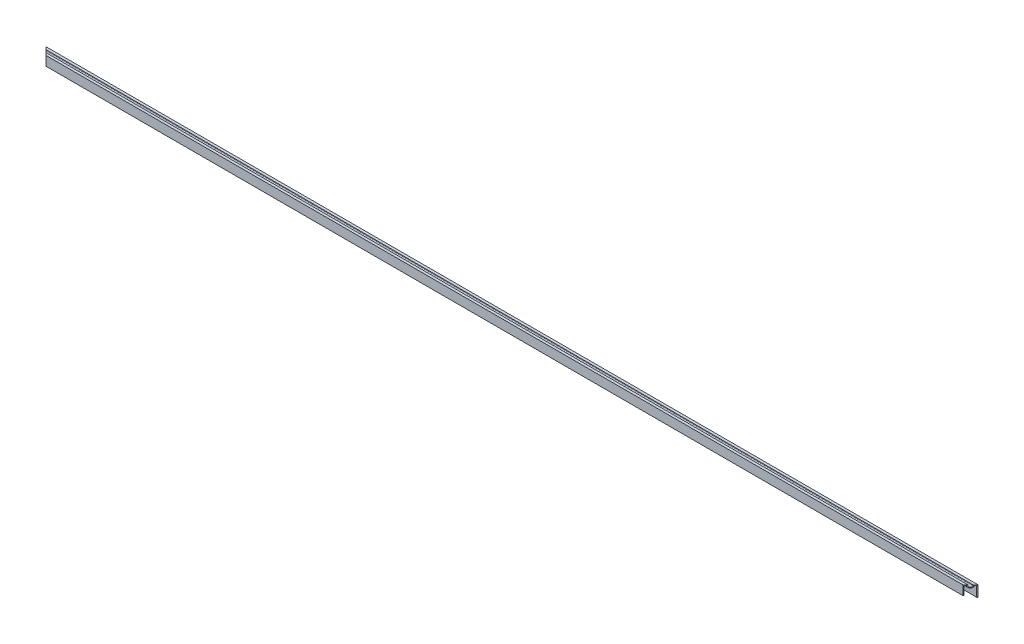
ISO-10303-21;
HEADER;
FILE_DESCRIPTION(('STEP AP214'),'2;1');
FILE_NAME('part.step','',(''),(''),'','','');
FILE_SCHEMA(('AUTOMOTIVE_DESIGN { 1 0 10303 214 1 1 1 1 }'));
ENDSEC;
DATA;
#1=APPLICATION_CONTEXT('core data for automotive mechanical design processes');
#2=APPLICATION_PROTOCOL_DEFINITION('international standard','automotive_design',2000,#1);
#3=PRODUCT_CONTEXT('',#1,'mechanical');
#4=PRODUCT('Part','Part','',(#3));
#5=PRODUCT_RELATED_PRODUCT_CATEGORY('part','',(#4));
#6=PRODUCT_DEFINITION_FORMATION('','',#4);
#7=PRODUCT_DEFINITION_CONTEXT('part definition',#1,'design');
#8=PRODUCT_DEFINITION('design','',#6,#7);
#9=PRODUCT_DEFINITION_SHAPE('','',#8);
#10=(LENGTH_UNIT() NAMED_UNIT(*) SI_UNIT(.MILLI.,.METRE.));
#11=(NAMED_UNIT(*) PLANE_ANGLE_UNIT() SI_UNIT($,.RADIAN.));
#12=(NAMED_UNIT(*) SI_UNIT($,.STERADIAN.) SOLID_ANGLE_UNIT());
#13=UNCERTAINTY_MEASURE_WITH_UNIT(LENGTH_MEASURE(1.E-05),#10,'distance_accuracy_value','');
#14=(GEOMETRIC_REPRESENTATION_CONTEXT(3) GLOBAL_UNCERTAINTY_ASSIGNED_CONTEXT((#13)) GLOBAL_UNIT_ASSIGNED_CONTEXT((#10,
#11,#12)) REPRESENTATION_CONTEXT('',''));
#15=CARTESIAN_POINT('',(0.,0.,0.));
#16=DIRECTION('',(0.,0.,1.));
#17=DIRECTION('',(1.,0.,0.));
#18=AXIS2_PLACEMENT_3D('',#15,#16,#17);
#19=CARTESIAN_POINT('',(934.24375,0.,0.));
#20=DIRECTION('',(0.,1.,0.));
#21=DIRECTION('',(0.,0.,1.));
#22=AXIS2_PLACEMENT_3D('',#19,#20,#21);
#23=PLANE('',#22);
#24=DIRECTION('',(-1.,0.,0.));
#25=VECTOR('',#24,1.);
#26=CARTESIAN_POINT('',(934.24375,0.,1.27));
#27=LINE('',#26,#25);
#28=CARTESIAN_POINT('',(932.97375,0.,1.27));
#29=VERTEX_POINT('',#28);
#30=CARTESIAN_POINT('',(-932.97375,0.,1.27000000000001));
#31=VERTEX_POINT('',#30);
#32=EDGE_CURVE('E169',#29,#31,#27,.T.);
#33=ORIENTED_EDGE('',*,*,#32,.T.);
#34=DIRECTION('',(-0.707106781186548,0.,-0.707106781186547));
#35=VECTOR('',#34,1.);
#36=CARTESIAN_POINT('',(-934.24375,0.,0.));
#37=LINE('',#36,#35);
#38=CARTESIAN_POINT('',(-934.24375,0.,0.));
#39=VERTEX_POINT('',#38);
#40=EDGE_CURVE('E155',#31,#39,#37,.T.);
#41=ORIENTED_EDGE('',*,*,#40,.T.);
#42=DIRECTION('',(-1.,0.,0.));
#43=VECTOR('',#42,1.);
#44=CARTESIAN_POINT('',(934.24375,0.,0.));
#45=LINE('',#44,#43);
#46=CARTESIAN_POINT('',(934.24375,0.,0.));
#47=VERTEX_POINT('',#46);
#48=EDGE_CURVE('E11',#47,#39,#45,.T.);
#49=ORIENTED_EDGE('',*,*,#48,.F.);
#50=DIRECTION('',(-0.707106781186548,0.,0.707106781186547));
#51=VECTOR('',#50,1.);
#52=CARTESIAN_POINT('',(934.24375,0.,0.));
#53=LINE('',#52,#51);
#54=EDGE_CURVE('E59',#47,#29,#53,.T.);
#55=ORIENTED_EDGE('',*,*,#54,.T.);
#56=EDGE_LOOP('',(#33,#41,#49,#55));
#57=FACE_BOUND('',#56,.T.);
#58=ADVANCED_FACE('F45',(#57),#23,.F.);
#59=CARTESIAN_POINT('',(934.24375,0.,0.));
#60=DIRECTION('',(0.,0.,1.));
#61=DIRECTION('',(1.,0.,0.));
#62=AXIS2_PLACEMENT_3D('',#59,#60,#61);
#63=PLANE('',#62);
#64=DIRECTION('',(0.,1.,0.));
#65=VECTOR('',#64,1.);
#66=CARTESIAN_POINT('',(-934.24375,0.,0.));
#67=LINE('',#66,#65);
#68=CARTESIAN_POINT('',(-934.24375,21.844,0.));
#69=VERTEX_POINT('',#68);
#70=EDGE_CURVE('E152',#39,#69,#67,.T.);
#71=ORIENTED_EDGE('',*,*,#70,.T.);
#72=DIRECTION('',(-1.,0.,0.));
#73=VECTOR('',#72,1.);
#74=CARTESIAN_POINT('',(934.24375,21.844,0.));
#75=LINE('',#74,#73);
#76=CARTESIAN_POINT('',(934.24375,21.844,0.));
#77=VERTEX_POINT('',#76);
#78=EDGE_CURVE('E53',#77,#69,#75,.T.);
#79=ORIENTED_EDGE('',*,*,#78,.F.);
#80=DIRECTION('',(0.,1.,0.));
#81=VECTOR('',#80,1.);
#82=CARTESIAN_POINT('',(934.24375,0.,0.));
#83=LINE('',#82,#81);
#84=EDGE_CURVE('E162',#47,#77,#83,.T.);
#85=ORIENTED_EDGE('',*,*,#84,.F.);
#86=ORIENTED_EDGE('',*,*,#48,.T.);
#87=EDGE_LOOP('',(#71,#79,#85,#86));
#88=FACE_BOUND('',#87,.T.);
#89=ADVANCED_FACE('F173',(#88),#63,.F.);
#90=CARTESIAN_POINT('',(934.24375,21.844,0.));
#91=DIRECTION('',(0.,-1.,0.));
#92=DIRECTION('',(0.,0.,-1.));
#93=AXIS2_PLACEMENT_3D('',#90,#91,#92);
#94=PLANE('',#93);
#95=ORIENTED_EDGE('',*,*,#78,.T.);
#96=DIRECTION('',(-0.707106781186548,0.,-0.707106781186547));
#97=VECTOR('',#96,1.);
#98=CARTESIAN_POINT('',(-934.24375,21.844,0.));
#99=LINE('',#98,#97);
#100=CARTESIAN_POINT('',(-929.16375,21.844,5.07999999999993));
#101=VERTEX_POINT('',#100);
#102=EDGE_CURVE('E158',#101,#69,#99,.T.);
#103=ORIENTED_EDGE('',*,*,#102,.F.);
#104=DIRECTION('',(-1.,0.,0.));
#105=VECTOR('',#104,1.);
#106=CARTESIAN_POINT('',(934.24375,21.844,5.08));
#107=LINE('',#106,#105);
#108=CARTESIAN_POINT('',(929.16375,21.844,5.08));
#109=VERTEX_POINT('',#108);
#110=EDGE_CURVE('E216',#109,#101,#107,.T.);
#111=ORIENTED_EDGE('',*,*,#110,.F.);
#112=DIRECTION('',(-0.707106781186548,0.,0.707106781186547));
#113=VECTOR('',#112,1.);
#114=CARTESIAN_POINT('',(934.24375,21.844,0.));
#115=LINE('',#114,#113);
#116=EDGE_CURVE('E221',#77,#109,#115,.T.);
#117=ORIENTED_EDGE('',*,*,#116,.F.);
#118=EDGE_LOOP('',(#95,#103,#111,#117));
#119=FACE_BOUND('',#118,.T.);
#120=ADVANCED_FACE('F219',(#119),#94,.F.);
#121=CARTESIAN_POINT('',(934.24375,21.844,5.08));
#122=DIRECTION('',(0.,0.,-1.));
#123=DIRECTION('',(-1.,0.,0.));
#124=AXIS2_PLACEMENT_3D('',#121,#122,#123);
#125=PLANE('',#124);
#126=ORIENTED_EDGE('',*,*,#110,.T.);
#127=DIRECTION('',(0.,-1.,0.));
#128=VECTOR('',#127,1.);
#129=CARTESIAN_POINT('',(-929.16375,21.8439999999987,5.08));
#130=LINE('',#129,#128);
#131=CARTESIAN_POINT('',(-929.16375,20.066,5.08));
#132=VERTEX_POINT('',#131);
#133=EDGE_CURVE('E227',#101,#132,#130,.T.);
#134=ORIENTED_EDGE('',*,*,#133,.T.);
#135=DIRECTION('',(-1.,0.,0.));
#136=VECTOR('',#135,1.);
#137=CARTESIAN_POINT('',(934.24375,20.066,5.08));
#138=LINE('',#137,#136);
#139=CARTESIAN_POINT('',(929.16375,20.066,5.08));
#140=VERTEX_POINT('',#139);
#141=EDGE_CURVE('E213',#140,#132,#138,.T.);
#142=ORIENTED_EDGE('',*,*,#141,.F.);
#143=DIRECTION('',(0.,1.,0.));
#144=VECTOR('',#143,1.);
#145=CARTESIAN_POINT('',(929.16375,21.844,5.08));
#146=LINE('',#145,#144);
#147=EDGE_CURVE('E163',#140,#109,#146,.T.);
#148=ORIENTED_EDGE('',*,*,#147,.T.);
#149=EDGE_LOOP('',(#126,#134,#142,#148));
#150=FACE_BOUND('',#149,.T.);
#151=ADVANCED_FACE('F264',(#150),#125,.F.);
#152=CARTESIAN_POINT('',(934.24375,20.066,7.62));
#153=DIRECTION('',(-1.,0.,0.));
#154=DIRECTION('',(0.,0.,1.));
#155=AXIS2_PLACEMENT_3D('',#152,#153,#154);
#156=CYLINDRICAL_SURFACE('',#155,2.54);
#157=ORIENTED_EDGE('',*,*,#141,.T.);
#158=CARTESIAN_POINT('',(-926.62375,20.066,7.62));
#159=DIRECTION('',(0.707106781186547,0.,-0.707106781186548));
#160=DIRECTION('',(-0.707106781186548,0.,-0.707106781186547));
#161=AXIS2_PLACEMENT_3D('',#158,#159,#160);
#162=ELLIPSE('',#161,3.59210244842767,2.54);
#163=CARTESIAN_POINT('',(-924.08375,20.066,10.16));
#164=VERTEX_POINT('',#163);
#165=EDGE_CURVE('E274',#132,#164,#162,.F.);
#166=ORIENTED_EDGE('',*,*,#165,.T.);
#167=DIRECTION('',(-1.,0.,0.));
#168=VECTOR('',#167,1.);
#169=CARTESIAN_POINT('',(934.24375,20.066,10.16));
#170=LINE('',#169,#168);
#171=CARTESIAN_POINT('',(924.08375,20.066,10.16));
#172=VERTEX_POINT('',#171);
#173=EDGE_CURVE('E210',#172,#164,#170,.T.);
#174=ORIENTED_EDGE('',*,*,#173,.F.);
#175=CARTESIAN_POINT('',(926.62375,20.066,7.62));
#176=DIRECTION('',(-0.707106781186547,0.,-0.707106781186548));
#177=DIRECTION('',(-0.707106781186548,0.,0.707106781186547));
#178=AXIS2_PLACEMENT_3D('',#175,#176,#177);
#179=ELLIPSE('',#178,3.59210244842767,2.54);
#180=EDGE_CURVE('E258',#172,#140,#179,.F.);
#181=ORIENTED_EDGE('',*,*,#180,.T.);
#182=EDGE_LOOP('',(#157,#166,#174,#181));
#183=FACE_BOUND('',#182,.T.);
#184=ADVANCED_FACE('F273',(#183),#156,.F.);
#185=CARTESIAN_POINT('',(934.24375,20.066,10.16));
#186=DIRECTION('',(0.,0.,1.));
#187=DIRECTION('',(0.,-1.,0.));
#188=AXIS2_PLACEMENT_3D('',#185,#186,#187);
#189=PLANE('',#188);
#190=ORIENTED_EDGE('',*,*,#173,.T.);
#191=DIRECTION('',(0.,1.,0.));
#192=VECTOR('',#191,1.);
#193=CARTESIAN_POINT('',(-924.08375,20.0659999999969,10.16));
#194=LINE('',#193,#192);
#195=CARTESIAN_POINT('',(-924.08375,21.844,10.1600000000001));
#196=VERTEX_POINT('',#195);
#197=EDGE_CURVE('E275',#164,#196,#194,.T.);
#198=ORIENTED_EDGE('',*,*,#197,.T.);
#199=DIRECTION('',(-1.,0.,0.));
#200=VECTOR('',#199,1.);
#201=CARTESIAN_POINT('',(934.24375,21.844,10.16));
#202=LINE('',#201,#200);
#203=CARTESIAN_POINT('',(924.08375,21.844,10.16));
#204=VERTEX_POINT('',#203);
#205=EDGE_CURVE('E207',#204,#196,#202,.T.);
#206=ORIENTED_EDGE('',*,*,#205,.F.);
#207=DIRECTION('',(0.,-1.,0.));
#208=VECTOR('',#207,1.);
#209=CARTESIAN_POINT('',(924.08375,20.066,10.16));
#210=LINE('',#209,#208);
#211=EDGE_CURVE('E256',#204,#172,#210,.T.);
#212=ORIENTED_EDGE('',*,*,#211,.T.);
#213=EDGE_LOOP('',(#190,#198,#206,#212));
#214=FACE_BOUND('',#213,.T.);
#215=ADVANCED_FACE('F270',(#214),#189,.F.);
#216=CARTESIAN_POINT('',(934.24375,21.844,10.16));
#217=DIRECTION('',(0.,-1.,0.));
#218=DIRECTION('',(0.,0.,-1.));
#219=AXIS2_PLACEMENT_3D('',#216,#217,#218);
#220=PLANE('',#219);
#221=ORIENTED_EDGE('',*,*,#205,.T.);
#222=CARTESIAN_POINT('',(-919.00375,21.844,15.24));
#223=VERTEX_POINT('',#222);
#224=EDGE_CURVE('E171',#223,#196,#99,.T.);
#225=ORIENTED_EDGE('',*,*,#224,.F.);
#226=DIRECTION('',(-1.,0.,0.));
#227=VECTOR('',#226,1.);
#228=CARTESIAN_POINT('',(934.24375,21.844,15.24));
#229=LINE('',#228,#227);
#230=CARTESIAN_POINT('',(919.00375,21.844,15.24));
#231=VERTEX_POINT('',#230);
#232=EDGE_CURVE('E204',#231,#223,#229,.T.);
#233=ORIENTED_EDGE('',*,*,#232,.F.);
#234=EDGE_CURVE('E223',#204,#231,#115,.T.);
#235=ORIENTED_EDGE('',*,*,#234,.F.);
#236=EDGE_LOOP('',(#221,#225,#233,#235));
#237=FACE_BOUND('',#236,.T.);
#238=ADVANCED_FACE('F307',(#237),#220,.F.);
#239=CARTESIAN_POINT('',(934.24375,21.844,15.24));
#240=DIRECTION('',(0.,0.,-1.));
#241=DIRECTION('',(0.,1.,0.));
#242=AXIS2_PLACEMENT_3D('',#239,#240,#241);
#243=PLANE('',#242);
#244=ORIENTED_EDGE('',*,*,#232,.T.);
#245=DIRECTION('',(0.,1.,0.));
#246=VECTOR('',#245,1.);
#247=CARTESIAN_POINT('',(-919.00375,0.,15.24));
#248=LINE('',#247,#246);
#249=CARTESIAN_POINT('',(-919.00375,3.048,15.24));
#250=VERTEX_POINT('',#249);
#251=EDGE_CURVE('E170',#250,#223,#248,.T.);
#252=ORIENTED_EDGE('',*,*,#251,.F.);
#253=DIRECTION('',(-1.,0.,0.));
#254=VECTOR('',#253,1.);
#255=CARTESIAN_POINT('',(934.24375,3.048,15.24));
#256=LINE('',#255,#254);
#257=CARTESIAN_POINT('',(919.00375,3.048,15.24));
#258=VERTEX_POINT('',#257);
#259=EDGE_CURVE('E201',#258,#250,#256,.T.);
#260=ORIENTED_EDGE('',*,*,#259,.F.);
#261=DIRECTION('',(0.,1.,0.));
#262=VECTOR('',#261,1.);
#263=CARTESIAN_POINT('',(919.00375,0.,15.24));
#264=LINE('',#263,#262);
#265=EDGE_CURVE('E225',#258,#231,#264,.T.);
#266=ORIENTED_EDGE('',*,*,#265,.T.);
#267=EDGE_LOOP('',(#244,#252,#260,#266));
#268=FACE_BOUND('',#267,.T.);
#269=ADVANCED_FACE('F310',(#268),#243,.F.);
#270=CARTESIAN_POINT('',(934.24375,3.048,15.24));
#271=DIRECTION('',(0.,1.,0.));
#272=DIRECTION('',(0.,0.,1.));
#273=AXIS2_PLACEMENT_3D('',#270,#271,#272);
#274=PLANE('',#273);
#275=ORIENTED_EDGE('',*,*,#259,.T.);
#276=DIRECTION('',(-0.707106781186548,0.,-0.707106781186547));
#277=VECTOR('',#276,1.);
#278=CARTESIAN_POINT('',(7.62000000000218,3.048,941.86375));
#279=LINE('',#278,#277);
#280=CARTESIAN_POINT('',(-920.27375,3.048,13.97));
#281=VERTEX_POINT('',#280);
#282=EDGE_CURVE('E277',#250,#281,#279,.T.);
#283=ORIENTED_EDGE('',*,*,#282,.T.);
#284=DIRECTION('',(-1.,0.,0.));
#285=VECTOR('',#284,1.);
#286=CARTESIAN_POINT('',(934.24375,3.048,13.97));
#287=LINE('',#286,#285);
#288=CARTESIAN_POINT('',(920.27375,3.048,13.97));
#289=VERTEX_POINT('',#288);
#290=EDGE_CURVE('E198',#289,#281,#287,.T.);
#291=ORIENTED_EDGE('',*,*,#290,.F.);
#292=DIRECTION('',(-0.707106781186548,0.,0.707106781186547));
#293=VECTOR('',#292,1.);
#294=CARTESIAN_POINT('',(926.62375,3.048,7.61999999999997));
#295=LINE('',#294,#293);
#296=EDGE_CURVE('E253',#289,#258,#295,.T.);
#297=ORIENTED_EDGE('',*,*,#296,.T.);
#298=EDGE_LOOP('',(#275,#283,#291,#297));
#299=FACE_BOUND('',#298,.T.);
#300=ADVANCED_FACE('F312',(#299),#274,.F.);
#301=CARTESIAN_POINT('',(934.24375,20.574,13.97));
#302=DIRECTION('',(0.,0.,1.));
#303=DIRECTION('',(1.,0.,0.));
#304=AXIS2_PLACEMENT_3D('',#301,#302,#303);
#305=PLANE('',#304);
#306=ORIENTED_EDGE('',*,*,#290,.T.);
#307=DIRECTION('',(0.,1.,0.));
#308=VECTOR('',#307,1.);
#309=CARTESIAN_POINT('',(-920.27375,20.5739999999987,13.97));
#310=LINE('',#309,#308);
#311=CARTESIAN_POINT('',(-920.27375,20.574,13.9699999999999));
#312=VERTEX_POINT('',#311);
#313=EDGE_CURVE('E282',#281,#312,#310,.T.);
#314=ORIENTED_EDGE('',*,*,#313,.T.);
#315=DIRECTION('',(-1.,0.,0.));
#316=VECTOR('',#315,1.);
#317=CARTESIAN_POINT('',(934.24375,20.574,13.97));
#318=LINE('',#317,#316);
#319=CARTESIAN_POINT('',(920.27375,20.574,13.97));
#320=VERTEX_POINT('',#319);
#321=EDGE_CURVE('E195',#320,#312,#318,.T.);
#322=ORIENTED_EDGE('',*,*,#321,.F.);
#323=DIRECTION('',(0.,-1.,0.));
#324=VECTOR('',#323,1.);
#325=CARTESIAN_POINT('',(920.27375,20.574,13.97));
#326=LINE('',#325,#324);
#327=EDGE_CURVE('E250',#320,#289,#326,.T.);
#328=ORIENTED_EDGE('',*,*,#327,.T.);
#329=EDGE_LOOP('',(#306,#314,#322,#328));
#330=FACE_BOUND('',#329,.T.);
#331=ADVANCED_FACE('F316',(#330),#305,.F.);
#332=CARTESIAN_POINT('',(934.24375,20.574,11.43));
#333=DIRECTION('',(0.,1.,0.));
#334=DIRECTION('',(0.,0.,1.));
#335=AXIS2_PLACEMENT_3D('',#332,#333,#334);
#336=PLANE('',#335);
#337=ORIENTED_EDGE('',*,*,#321,.T.);
#338=DIRECTION('',(-0.707106781186548,0.,-0.707106781186547));
#339=VECTOR('',#338,1.);
#340=CARTESIAN_POINT('',(5.71500000000225,20.574,939.95875));
#341=LINE('',#340,#339);
#342=CARTESIAN_POINT('',(-922.81375,20.574,11.43));
#343=VERTEX_POINT('',#342);
#344=EDGE_CURVE('E285',#312,#343,#341,.T.);
#345=ORIENTED_EDGE('',*,*,#344,.T.);
#346=DIRECTION('',(-1.,0.,0.));
#347=VECTOR('',#346,1.);
#348=CARTESIAN_POINT('',(934.24375,20.574,11.43));
#349=LINE('',#348,#347);
#350=CARTESIAN_POINT('',(922.81375,20.574,11.43));
#351=VERTEX_POINT('',#350);
#352=EDGE_CURVE('E192',#351,#343,#349,.T.);
#353=ORIENTED_EDGE('',*,*,#352,.F.);
#354=DIRECTION('',(-0.707106781186548,0.,0.707106781186547));
#355=VECTOR('',#354,1.);
#356=CARTESIAN_POINT('',(928.52875,20.574,5.71499999999998));
#357=LINE('',#356,#355);
#358=EDGE_CURVE('E247',#351,#320,#357,.T.);
#359=ORIENTED_EDGE('',*,*,#358,.T.);
#360=EDGE_LOOP('',(#337,#345,#353,#359));
#361=FACE_BOUND('',#360,.T.);
#362=ADVANCED_FACE('F318',(#361),#336,.F.);
#363=CARTESIAN_POINT('',(934.24375,20.066,11.43));
#364=DIRECTION('',(0.,0.,-1.));
#365=DIRECTION('',(-1.,0.,0.));
#366=AXIS2_PLACEMENT_3D('',#363,#364,#365);
#367=PLANE('',#366);
#368=ORIENTED_EDGE('',*,*,#352,.T.);
#369=DIRECTION('',(0.,-1.,0.));
#370=VECTOR('',#369,1.);
#371=CARTESIAN_POINT('',(-922.81375,20.0659999999987,11.43));
#372=LINE('',#371,#370);
#373=CARTESIAN_POINT('',(-922.81375,20.066,11.43));
#374=VERTEX_POINT('',#373);
#375=EDGE_CURVE('E288',#343,#374,#372,.T.);
#376=ORIENTED_EDGE('',*,*,#375,.T.);
#377=DIRECTION('',(-1.,0.,0.));
#378=VECTOR('',#377,1.);
#379=CARTESIAN_POINT('',(934.24375,20.066,11.43));
#380=LINE('',#379,#378);
#381=CARTESIAN_POINT('',(922.81375,20.066,11.43));
#382=VERTEX_POINT('',#381);
#383=EDGE_CURVE('E189',#382,#374,#380,.T.);
#384=ORIENTED_EDGE('',*,*,#383,.F.);
#385=DIRECTION('',(0.,1.,0.));
#386=VECTOR('',#385,1.);
#387=CARTESIAN_POINT('',(922.81375,20.066,11.43));
#388=LINE('',#387,#386);
#389=EDGE_CURVE('E244',#382,#351,#388,.T.);
#390=ORIENTED_EDGE('',*,*,#389,.T.);
#391=EDGE_LOOP('',(#368,#376,#384,#390));
#392=FACE_BOUND('',#391,.T.);
#393=ADVANCED_FACE('F322',(#392),#367,.F.);
#394=CARTESIAN_POINT('',(934.24375,20.066,7.62));
#395=DIRECTION('',(-1.,0.,0.));
#396=DIRECTION('',(0.,0.,1.));
#397=AXIS2_PLACEMENT_3D('',#394,#395,#396);
#398=CYLINDRICAL_SURFACE('',#397,3.81);
#399=ORIENTED_EDGE('',*,*,#383,.T.);
#400=CARTESIAN_POINT('',(-926.62375,20.066,7.62));
#401=DIRECTION('',(0.707106781186547,0.,-0.707106781186548));
#402=DIRECTION('',(-0.707106781186548,0.,-0.707106781186547));
#403=AXIS2_PLACEMENT_3D('',#400,#401,#402);
#404=ELLIPSE('',#403,5.3881536726415,3.81);
#405=CARTESIAN_POINT('',(-930.43375,20.066,3.81));
#406=VERTEX_POINT('',#405);
#407=EDGE_CURVE('E291',#374,#406,#404,.T.);
#408=ORIENTED_EDGE('',*,*,#407,.T.);
#409=DIRECTION('',(-1.,0.,0.));
#410=VECTOR('',#409,1.);
#411=CARTESIAN_POINT('',(934.24375,20.066,3.81));
#412=LINE('',#411,#410);
#413=CARTESIAN_POINT('',(930.43375,20.066,3.81));
#414=VERTEX_POINT('',#413);
#415=EDGE_CURVE('E186',#414,#406,#412,.T.);
#416=ORIENTED_EDGE('',*,*,#415,.F.);
#417=CARTESIAN_POINT('',(926.62375,20.066,7.62));
#418=DIRECTION('',(-0.707106781186547,0.,-0.707106781186548));
#419=DIRECTION('',(-0.707106781186548,0.,0.707106781186547));
#420=AXIS2_PLACEMENT_3D('',#417,#418,#419);
#421=ELLIPSE('',#420,5.3881536726415,3.81);
#422=EDGE_CURVE('E241',#414,#382,#421,.T.);
#423=ORIENTED_EDGE('',*,*,#422,.T.);
#424=EDGE_LOOP('',(#399,#408,#416,#423));
#425=FACE_BOUND('',#424,.T.);
#426=ADVANCED_FACE('F324',(#425),#398,.T.);
#427=CARTESIAN_POINT('',(934.24375,20.574,3.81));
#428=DIRECTION('',(0.,0.,1.));
#429=DIRECTION('',(1.,0.,0.));
#430=AXIS2_PLACEMENT_3D('',#427,#428,#429);
#431=PLANE('',#430);
#432=ORIENTED_EDGE('',*,*,#415,.T.);
#433=DIRECTION('',(0.,1.,0.));
#434=VECTOR('',#433,1.);
#435=CARTESIAN_POINT('',(-930.43375,20.5739999999987,3.81));
#436=LINE('',#435,#434);
#437=CARTESIAN_POINT('',(-930.43375,20.574,3.80999999999998));
#438=VERTEX_POINT('',#437);
#439=EDGE_CURVE('E294',#406,#438,#436,.T.);
#440=ORIENTED_EDGE('',*,*,#439,.T.);
#441=DIRECTION('',(-1.,0.,0.));
#442=VECTOR('',#441,1.);
#443=CARTESIAN_POINT('',(934.24375,20.574,3.81));
#444=LINE('',#443,#442);
#445=CARTESIAN_POINT('',(930.43375,20.574,3.81));
#446=VERTEX_POINT('',#445);
#447=EDGE_CURVE('E183',#446,#438,#444,.T.);
#448=ORIENTED_EDGE('',*,*,#447,.F.);
#449=DIRECTION('',(0.,-1.,0.));
#450=VECTOR('',#449,1.);
#451=CARTESIAN_POINT('',(930.43375,20.574,3.81));
#452=LINE('',#451,#450);
#453=EDGE_CURVE('E238',#446,#414,#452,.T.);
#454=ORIENTED_EDGE('',*,*,#453,.T.);
#455=EDGE_LOOP('',(#432,#440,#448,#454));
#456=FACE_BOUND('',#455,.T.);
#457=ADVANCED_FACE('F328',(#456),#431,.F.);
#458=CARTESIAN_POINT('',(934.24375,20.574,1.27));
#459=DIRECTION('',(0.,1.,0.));
#460=DIRECTION('',(0.,0.,1.));
#461=AXIS2_PLACEMENT_3D('',#458,#459,#460);
#462=PLANE('',#461);
#463=ORIENTED_EDGE('',*,*,#447,.T.);
#464=DIRECTION('',(-0.707106781186548,0.,-0.707106781186547));
#465=VECTOR('',#464,1.);
#466=CARTESIAN_POINT('',(0.635000000002273,20.574,934.87875));
#467=LINE('',#466,#465);
#468=CARTESIAN_POINT('',(-932.97375,20.574,1.27));
#469=VERTEX_POINT('',#468);
#470=EDGE_CURVE('E297',#438,#469,#467,.T.);
#471=ORIENTED_EDGE('',*,*,#470,.T.);
#472=DIRECTION('',(-1.,0.,0.));
#473=VECTOR('',#472,1.);
#474=CARTESIAN_POINT('',(934.24375,20.574,1.27));
#475=LINE('',#474,#473);
#476=CARTESIAN_POINT('',(932.97375,20.574,1.27));
#477=VERTEX_POINT('',#476);
#478=EDGE_CURVE('E176',#477,#469,#475,.T.);
#479=ORIENTED_EDGE('',*,*,#478,.F.);
#480=DIRECTION('',(-0.707106781186548,0.,0.707106781186547));
#481=VECTOR('',#480,1.);
#482=CARTESIAN_POINT('',(933.60875,20.574,0.634999999999998));
#483=LINE('',#482,#481);
#484=EDGE_CURVE('E235',#477,#446,#483,.T.);
#485=ORIENTED_EDGE('',*,*,#484,.T.);
#486=EDGE_LOOP('',(#463,#471,#479,#485));
#487=FACE_BOUND('',#486,.T.);
#488=ADVANCED_FACE('F330',(#487),#462,.F.);
#489=CARTESIAN_POINT('',(934.24375,0.,1.27));
#490=DIRECTION('',(0.,0.,-1.));
#491=DIRECTION('',(-1.,0.,0.));
#492=AXIS2_PLACEMENT_3D('',#489,#490,#491);
#493=PLANE('',#492);
#494=ORIENTED_EDGE('',*,*,#478,.T.);
#495=DIRECTION('',(0.,-1.,0.));
#496=VECTOR('',#495,1.);
#497=CARTESIAN_POINT('',(-932.97375,-1.27523859527745E-12,1.27));
#498=LINE('',#497,#496);
#499=EDGE_CURVE('E300',#469,#31,#498,.T.);
#500=ORIENTED_EDGE('',*,*,#499,.T.);
#501=ORIENTED_EDGE('',*,*,#32,.F.);
#502=DIRECTION('',(0.,1.,0.));
#503=VECTOR('',#502,1.);
#504=CARTESIAN_POINT('',(932.97375,0.,1.27));
#505=LINE('',#504,#503);
#506=EDGE_CURVE('E232',#29,#477,#505,.T.);
#507=ORIENTED_EDGE('',*,*,#506,.T.);
#508=EDGE_LOOP('',(#494,#500,#501,#507));
#509=FACE_BOUND('',#508,.T.);
#510=ADVANCED_FACE('F333',(#509),#493,.F.);
#511=CARTESIAN_POINT('',(934.24375,0.,0.));
#512=DIRECTION('',(-0.707106781186547,0.,-0.707106781186548));
#513=DIRECTION('',(-0.707106781186548,0.,0.707106781186547));
#514=AXIS2_PLACEMENT_3D('',#511,#512,#513);
#515=PLANE('',#514);
#516=ORIENTED_EDGE('',*,*,#180,.F.);
#517=ORIENTED_EDGE('',*,*,#211,.F.);
#518=ORIENTED_EDGE('',*,*,#234,.T.);
#519=ORIENTED_EDGE('',*,*,#265,.F.);
#520=ORIENTED_EDGE('',*,*,#296,.F.);
#521=ORIENTED_EDGE('',*,*,#327,.F.);
#522=ORIENTED_EDGE('',*,*,#358,.F.);
#523=ORIENTED_EDGE('',*,*,#389,.F.);
#524=ORIENTED_EDGE('',*,*,#422,.F.);
#525=ORIENTED_EDGE('',*,*,#453,.F.);
#526=ORIENTED_EDGE('',*,*,#484,.F.);
#527=ORIENTED_EDGE('',*,*,#506,.F.);
#528=ORIENTED_EDGE('',*,*,#54,.F.);
#529=ORIENTED_EDGE('',*,*,#84,.T.);
#530=ORIENTED_EDGE('',*,*,#116,.T.);
#531=ORIENTED_EDGE('',*,*,#147,.F.);
#532=EDGE_LOOP('',(#516,#517,#518,#519,#520,#521,#522,#523,#524,#525,#526,#527,#528,#529,#530,#531));
#533=FACE_BOUND('',#532,.T.);
#534=ADVANCED_FACE('F266',(#533),#515,.F.);
#535=CARTESIAN_POINT('',(-934.24375,0.,0.));
#536=DIRECTION('',(0.707106781186547,0.,-0.707106781186548));
#537=DIRECTION('',(-0.707106781186548,0.,-0.707106781186547));
#538=AXIS2_PLACEMENT_3D('',#535,#536,#537);
#539=PLANE('',#538);
#540=ORIENTED_EDGE('',*,*,#102,.T.);
#541=ORIENTED_EDGE('',*,*,#70,.F.);
#542=ORIENTED_EDGE('',*,*,#40,.F.);
#543=ORIENTED_EDGE('',*,*,#499,.F.);
#544=ORIENTED_EDGE('',*,*,#470,.F.);
#545=ORIENTED_EDGE('',*,*,#439,.F.);
#546=ORIENTED_EDGE('',*,*,#407,.F.);
#547=ORIENTED_EDGE('',*,*,#375,.F.);
#548=ORIENTED_EDGE('',*,*,#344,.F.);
#549=ORIENTED_EDGE('',*,*,#313,.F.);
#550=ORIENTED_EDGE('',*,*,#282,.F.);
#551=ORIENTED_EDGE('',*,*,#251,.T.);
#552=ORIENTED_EDGE('',*,*,#224,.T.);
#553=ORIENTED_EDGE('',*,*,#197,.F.);
#554=ORIENTED_EDGE('',*,*,#165,.F.);
#555=ORIENTED_EDGE('',*,*,#133,.F.);
#556=EDGE_LOOP('',(#540,#541,#542,#543,#544,#545,#546,#547,#548,#549,#550,#551,#552,#553,#554,#555));
#557=FACE_BOUND('',#556,.T.);
#558=ADVANCED_FACE('F154',(#557),#539,.F.);
#559=CLOSED_SHELL('',(#58,#89,#120,#151,#184,#215,#238,#269,#300,#331,#362,#393,#426,#457,#488,
#510,#534,#558));
#560=MANIFOLD_SOLID_BREP('B2',#559);
#561=ADVANCED_BREP_SHAPE_REPRESENTATION('',(#18,#560),#14);
#562=SHAPE_DEFINITION_REPRESENTATION(#9,#561);
ENDSEC;
END-ISO-10303-21;
